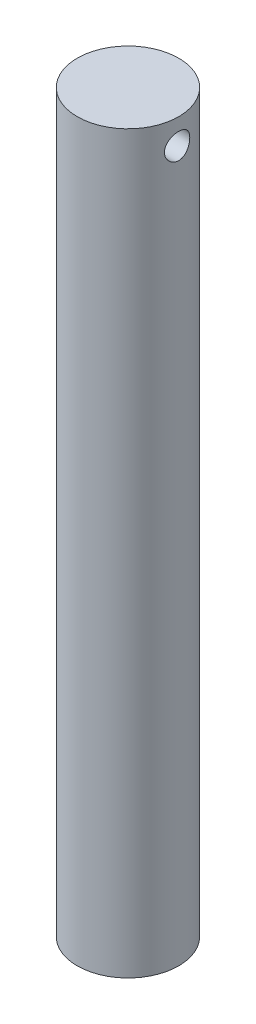
ISO-10303-21;
HEADER;
FILE_DESCRIPTION(('STEP AP214'),'2;1');
FILE_NAME('part.step','',(''),(''),'','','');
FILE_SCHEMA(('AUTOMOTIVE_DESIGN { 1 0 10303 214 1 1 1 1 }'));
ENDSEC;
DATA;
#1=APPLICATION_CONTEXT('core data for automotive mechanical design processes');
#2=APPLICATION_PROTOCOL_DEFINITION('international standard','automotive_design',2000,#1);
#3=PRODUCT_CONTEXT('',#1,'mechanical');
#4=PRODUCT('Part','Part','',(#3));
#5=PRODUCT_RELATED_PRODUCT_CATEGORY('part','',(#4));
#6=PRODUCT_DEFINITION_FORMATION('','',#4);
#7=PRODUCT_DEFINITION_CONTEXT('part definition',#1,'design');
#8=PRODUCT_DEFINITION('design','',#6,#7);
#9=PRODUCT_DEFINITION_SHAPE('','',#8);
#10=(LENGTH_UNIT() NAMED_UNIT(*) SI_UNIT(.MILLI.,.METRE.));
#11=(NAMED_UNIT(*) PLANE_ANGLE_UNIT() SI_UNIT($,.RADIAN.));
#12=(NAMED_UNIT(*) SI_UNIT($,.STERADIAN.) SOLID_ANGLE_UNIT());
#13=UNCERTAINTY_MEASURE_WITH_UNIT(LENGTH_MEASURE(1.E-05),#10,'distance_accuracy_value','');
#14=(GEOMETRIC_REPRESENTATION_CONTEXT(3) GLOBAL_UNCERTAINTY_ASSIGNED_CONTEXT((#13)) GLOBAL_UNIT_ASSIGNED_CONTEXT((#10,
#11,#12)) REPRESENTATION_CONTEXT('',''));
#15=CARTESIAN_POINT('',(0.,0.,0.));
#16=DIRECTION('',(0.,0.,1.));
#17=DIRECTION('',(1.,0.,0.));
#18=AXIS2_PLACEMENT_3D('',#15,#16,#17);
#19=CARTESIAN_POINT('',(0.,184.15,0.));
#20=DIRECTION('',(0.,-1.,0.));
#21=DIRECTION('',(0.,0.,-1.));
#22=AXIS2_PLACEMENT_3D('',#19,#20,#21);
#23=CYLINDRICAL_SURFACE('',#22,12.7);
#24=CARTESIAN_POINT('',(-12.2967221242086,177.8,-3.175));
#25=CARTESIAN_POINT('',(-12.2967254711158,177.975324453677,-3.1749950198132));
#26=CARTESIAN_POINT('',(-12.3005126863854,178.150704021322,-3.16042833178202));
#27=CARTESIAN_POINT('',(-12.3152136473056,178.49642682428,-3.10263936933901));
#28=CARTESIAN_POINT('',(-12.3261315404947,178.666767068175,-3.05940041756247));
#29=CARTESIAN_POINT('',(-12.3537818023711,178.997360493498,-2.94575382353269));
#30=CARTESIAN_POINT('',(-12.3705066621688,179.15762638734,-2.8753812543752));
#31=CARTESIAN_POINT('',(-12.4078770387652,179.464094782726,-2.70957184940195));
#32=CARTESIAN_POINT('',(-12.4285227220068,179.610296686842,-2.61413394947206));
#33=CARTESIAN_POINT('',(-12.4719170977164,179.887704289483,-2.39865970268608));
#34=CARTESIAN_POINT('',(-12.4946993898125,180.018554872445,-2.27817284738413));
#35=CARTESIAN_POINT('',(-12.5395085190442,180.258416970838,-2.01699122140784));
#36=CARTESIAN_POINT('',(-12.5615352853931,180.36742644454,-1.876294563609));
#37=CARTESIAN_POINT('',(-12.6027232771114,180.561964843892,-1.57625440537028));
#38=CARTESIAN_POINT('',(-12.6218402299875,180.647144912965,-1.41667811176781));
#39=CARTESIAN_POINT('',(-12.65467131146,180.789338248074,-1.0849142440518));
#40=CARTESIAN_POINT('',(-12.6683862371462,180.846355669933,-0.912728534955752));
#41=CARTESIAN_POINT('',(-12.6886304373719,180.929467749915,-0.564335623617769));
#42=CARTESIAN_POINT('',(-12.6952996518228,180.956165448295,-0.388280553827185));
#43=CARTESIAN_POINT('',(-12.7011886451627,180.97977314168,-0.0340726004637066));
#44=CARTESIAN_POINT('',(-12.7004095254282,180.976687540706,0.144079969063357));
#45=CARTESIAN_POINT('',(-12.6915938059099,180.941249940182,0.493243384772339));
#46=CARTESIAN_POINT('',(-12.6837186297291,180.909548867182,0.664324984533398));
#47=CARTESIAN_POINT('',(-12.6617836238657,180.818826487038,0.998658935538463));
#48=CARTESIAN_POINT('',(-12.6477234649603,180.759803725571,1.16191086950115));
#49=CARTESIAN_POINT('',(-12.6147513732012,180.615586735227,1.47766628361824));
#50=CARTESIAN_POINT('',(-12.5957967501266,180.53016085328,1.63005931850866));
#51=CARTESIAN_POINT('',(-12.5550917783831,180.335738287522,1.91857510093106));
#52=CARTESIAN_POINT('',(-12.5333409435887,180.226737502928,2.05469501139649));
#53=CARTESIAN_POINT('',(-12.4887191648708,179.984769897682,2.31068256139474));
#54=CARTESIAN_POINT('',(-12.4658338379713,179.851234286718,2.43001063106376));
#55=CARTESIAN_POINT('',(-12.4220610526701,179.565808033604,2.6446999936826));
#56=CARTESIAN_POINT('',(-12.4011736876753,179.413916534046,2.74006016644615));
#57=CARTESIAN_POINT('',(-12.3637103097324,179.095031656631,2.90445230964672));
#58=CARTESIAN_POINT('',(-12.347155693206,178.927968622503,2.97335437513119));
#59=CARTESIAN_POINT('',(-12.3205067298881,178.584116455542,3.08192684552052));
#60=CARTESIAN_POINT('',(-12.3104110007027,178.40732941274,3.12160350580598));
#61=CARTESIAN_POINT('',(-12.2981130212947,178.054051433057,3.16970364110572));
#62=CARTESIAN_POINT('',(-12.2957093300071,177.877676002457,3.17892490187728));
#63=CARTESIAN_POINT('',(-12.2985192607316,177.525906140537,3.16803657795425));
#64=CARTESIAN_POINT('',(-12.3037321815428,177.350511620404,3.14792969326925));
#65=CARTESIAN_POINT('',(-12.3209949412092,177.008644883515,3.07965533920158));
#66=CARTESIAN_POINT('',(-12.3329315220802,176.842073637257,3.03195236671801));
#67=CARTESIAN_POINT('',(-12.3621891219376,176.519292048526,2.91035496372148));
#68=CARTESIAN_POINT('',(-12.3795107787294,176.363082935999,2.83645743059487));
#69=CARTESIAN_POINT('',(-12.418010941113,176.062079577109,2.66289874827948));
#70=CARTESIAN_POINT('',(-12.439258441312,175.917569373145,2.56276062737126));
#71=CARTESIAN_POINT('',(-12.4830469550031,175.647110779242,2.34016643006687));
#72=CARTESIAN_POINT('',(-12.5055881806495,175.521165445854,2.21770668600725));
#73=CARTESIAN_POINT('',(-12.5501070185035,175.288179975935,1.95028413912649));
#74=CARTESIAN_POINT('',(-12.5720564161859,175.181691720563,1.80483494928779));
#75=CARTESIAN_POINT('',(-12.6123346509939,174.994651448972,1.49765601755558));
#76=CARTESIAN_POINT('',(-12.6306636769502,174.914098079908,1.33592712544034));
#77=CARTESIAN_POINT('',(-12.6615204698767,174.78191353615,1.00189729049621));
#78=CARTESIAN_POINT('',(-12.6740898412846,174.730074358839,0.829682684763523));
#79=CARTESIAN_POINT('',(-12.6921932261265,174.656165375047,0.478630489012209));
#80=CARTESIAN_POINT('',(-12.6977285972965,174.634089823401,0.299794184005931));
#81=CARTESIAN_POINT('',(-12.7010848787296,174.620657903098,-0.054240196457561));
#82=CARTESIAN_POINT('',(-12.6991103294396,174.628487073622,-0.229405900617127));
#83=CARTESIAN_POINT('',(-12.6881222125238,174.67277685166,-0.575841801116841));
#84=CARTESIAN_POINT('',(-12.6791088542401,174.709236607667,-0.747112113154456));
#85=CARTESIAN_POINT('',(-12.655087493111,174.809315797773,-1.08004303817217));
#86=CARTESIAN_POINT('',(-12.640112022951,174.872787964273,-1.24175042029425));
#87=CARTESIAN_POINT('',(-12.6057434230086,175.024956588387,-1.55231164340716));
#88=CARTESIAN_POINT('',(-12.5863497364056,175.113656225729,-1.70116386101839));
#89=CARTESIAN_POINT('',(-12.5446551773491,175.316245867938,-1.985651122744));
#90=CARTESIAN_POINT('',(-12.5222957878979,175.43068845372,-2.12088408784723));
#91=CARTESIAN_POINT('',(-12.4774531075658,175.680442555028,-2.37050268936839));
#92=CARTESIAN_POINT('',(-12.4549697867118,175.815759353653,-2.48488303211818));
#93=CARTESIAN_POINT('',(-12.4119473580947,176.106459490052,-2.69164443404807));
#94=CARTESIAN_POINT('',(-12.3914523466269,176.262170091685,-2.78357526664701));
#95=CARTESIAN_POINT('',(-12.3553205869608,176.587326180353,-2.93981789665887));
#96=CARTESIAN_POINT('',(-12.3396803064045,176.756761567348,-3.00414978846308));
#97=CARTESIAN_POINT('',(-12.3174731028359,177.071582012577,-3.09379152821293));
#98=CARTESIAN_POINT('',(-12.3097500503611,177.215460796926,-3.12417831664509));
#99=CARTESIAN_POINT('',(-12.2993733749982,177.506213659068,-3.16478377891537));
#100=CARTESIAN_POINT('',(-12.2967193196792,177.653087480276,-3.17500417313031));
#101=CARTESIAN_POINT('',(-12.2967221242086,177.8,-3.175));
#102=B_SPLINE_CURVE_WITH_KNOTS('',3,(#24,#25,#26,#27,#28,#29,#30,#31,#32,#33,#34,#35,#36,#37,
#38,#39,#40,#41,#42,#43,#44,#45,#46,#47,#48,#49,#50,#51,#52,#53,#54,#55,#56,#57,#58,#59,#60,#61,
#62,#63,#64,#65,#66,#67,#68,#69,#70,#71,#72,#73,#74,#75,#76,#77,#78,#79,#80,#81,#82,#83,#84,#85,
#86,#87,#88,#89,#90,#91,#92,#93,#94,#95,#96,#97,#98,#99,#100,#101),.UNSPECIFIED.,.T.,.F.,(4,2,2,
2,2,2,2,2,2,2,2,2,2,2,2,2,2,2,2,2,2,2,2,2,2,2,2,2,2,2,2,2,2,2,2,2,2,2,4),(0.,0.525433851004907,
1.05117359161441,1.57623602350087,2.10132074979461,2.63682421825079,3.17237772279429,
3.71540400425358,4.25835013005808,4.79029713764091,5.32216548805847,5.84223193614963,
6.36232607040479,6.88711950303145,7.41200429545521,7.9510949254633,8.49021074623751,
9.03194068650673,9.57355464164526,10.1008633995054,10.6281236152971,11.1467570436797,
11.6654519221148,12.1943221424741,12.7232793399029,13.2654717033224,13.8076357797011,
14.3458193247108,14.8838989712076,15.4074297658815,15.9309449907505,16.4516419323711,
16.9724045329363,17.5056431266551,18.0390169009448,18.5823412615974,19.1252693614627,
19.5655924052587,20.0058778838705),.UNSPECIFIED.);
#103=CARTESIAN_POINT('',(-12.2967221242086,177.8,-3.175));
#104=VERTEX_POINT('',#103);
#105=EDGE_CURVE('E10',#104,#104,#102,.T.);
#106=ORIENTED_EDGE('',*,*,#105,.T.);
#107=EDGE_LOOP('',(#106));
#108=FACE_BOUND('',#107,.T.);
#109=CARTESIAN_POINT('',(12.2967221242086,177.8,-3.175));
#110=CARTESIAN_POINT('',(12.2967254711158,177.624675546323,-3.1749950198132));
#111=CARTESIAN_POINT('',(12.3005126863854,177.449295978678,-3.16042833178202));
#112=CARTESIAN_POINT('',(12.3152136473056,177.10357317572,-3.10263936933902));
#113=CARTESIAN_POINT('',(12.3261315404947,176.933232931825,-3.05940041756247));
#114=CARTESIAN_POINT('',(12.3537818023711,176.602639506502,-2.94575382353269));
#115=CARTESIAN_POINT('',(12.3705066621688,176.44237361266,-2.8753812543752));
#116=CARTESIAN_POINT('',(12.4078770387652,176.135905217274,-2.70957184940195));
#117=CARTESIAN_POINT('',(12.4285227220068,175.989703313158,-2.61413394947206));
#118=CARTESIAN_POINT('',(12.4719170977164,175.712295710517,-2.39865970268608));
#119=CARTESIAN_POINT('',(12.4946993898125,175.581445127555,-2.27817284738413));
#120=CARTESIAN_POINT('',(12.5395085190442,175.341583029162,-2.01699122140784));
#121=CARTESIAN_POINT('',(12.5615352853931,175.23257355546,-1.876294563609));
#122=CARTESIAN_POINT('',(12.6027232771114,175.038035156108,-1.57625440537028));
#123=CARTESIAN_POINT('',(12.6218402299875,174.952855087035,-1.41667811176781));
#124=CARTESIAN_POINT('',(12.65467131146,174.810661751926,-1.0849142440518));
#125=CARTESIAN_POINT('',(12.6683862371462,174.753644330067,-0.912728534955752));
#126=CARTESIAN_POINT('',(12.6886304373719,174.670532250085,-0.564335623617769));
#127=CARTESIAN_POINT('',(12.6952996518228,174.643834551705,-0.388280553827185));
#128=CARTESIAN_POINT('',(12.7011886451627,174.62022685832,-0.0340726004637066));
#129=CARTESIAN_POINT('',(12.7004095254282,174.623312459294,0.144079969063357));
#130=CARTESIAN_POINT('',(12.6915938059099,174.658750059818,0.493243384772339));
#131=CARTESIAN_POINT('',(12.6837186297291,174.690451132818,0.664324984533398));
#132=CARTESIAN_POINT('',(12.6617836238657,174.781173512962,0.998658935538463));
#133=CARTESIAN_POINT('',(12.6477234649603,174.840196274429,1.16191086950115));
#134=CARTESIAN_POINT('',(12.6147513732012,174.984413264773,1.47766628361824));
#135=CARTESIAN_POINT('',(12.5957967501266,175.06983914672,1.63005931850866));
#136=CARTESIAN_POINT('',(12.5550917783831,175.264261712478,1.91857510093106));
#137=CARTESIAN_POINT('',(12.5333409435887,175.373262497072,2.05469501139649));
#138=CARTESIAN_POINT('',(12.4887191648708,175.615230102318,2.31068256139474));
#139=CARTESIAN_POINT('',(12.4658338379713,175.748765713282,2.43001063106376));
#140=CARTESIAN_POINT('',(12.4220610526701,176.034191966396,2.6446999936826));
#141=CARTESIAN_POINT('',(12.4011736876753,176.186083465954,2.74006016644615));
#142=CARTESIAN_POINT('',(12.3637103097324,176.504968343369,2.90445230964672));
#143=CARTESIAN_POINT('',(12.347155693206,176.672031377497,2.97335437513119));
#144=CARTESIAN_POINT('',(12.3205067298881,177.015883544458,3.08192684552052));
#145=CARTESIAN_POINT('',(12.3104110007027,177.19267058726,3.12160350580598));
#146=CARTESIAN_POINT('',(12.2981130212947,177.545948566943,3.16970364110572));
#147=CARTESIAN_POINT('',(12.2957093300071,177.722323997543,3.17892490187728));
#148=CARTESIAN_POINT('',(12.2985192607316,178.074093859463,3.16803657795425));
#149=CARTESIAN_POINT('',(12.3037321815428,178.249488379596,3.14792969326925));
#150=CARTESIAN_POINT('',(12.3209949412092,178.591355116485,3.07965533920158));
#151=CARTESIAN_POINT('',(12.3329315220802,178.757926362743,3.03195236671802));
#152=CARTESIAN_POINT('',(12.3621891219376,179.080707951474,2.91035496372149));
#153=CARTESIAN_POINT('',(12.3795107787294,179.236917064001,2.83645743059487));
#154=CARTESIAN_POINT('',(12.418010941113,179.537920422891,2.66289874827948));
#155=CARTESIAN_POINT('',(12.439258441312,179.682430626855,2.56276062737126));
#156=CARTESIAN_POINT('',(12.4830469550031,179.952889220758,2.34016643006687));
#157=CARTESIAN_POINT('',(12.5055881806495,180.078834554146,2.21770668600725));
#158=CARTESIAN_POINT('',(12.5501070185035,180.311820024065,1.95028413912649));
#159=CARTESIAN_POINT('',(12.5720564161859,180.418308279437,1.80483494928779));
#160=CARTESIAN_POINT('',(12.6123346509939,180.605348551028,1.49765601755558));
#161=CARTESIAN_POINT('',(12.6306636769502,180.685901920092,1.33592712544034));
#162=CARTESIAN_POINT('',(12.6615204698767,180.81808646385,1.0018972904962));
#163=CARTESIAN_POINT('',(12.6740898412846,180.869925641161,0.829682684763519));
#164=CARTESIAN_POINT('',(12.6921932261265,180.943834624953,0.478630489012205));
#165=CARTESIAN_POINT('',(12.6977285972965,180.965910176599,0.299794184005929));
#166=CARTESIAN_POINT('',(12.7010848787296,180.979342096902,-0.0542401964575609));
#167=CARTESIAN_POINT('',(12.6991103294396,180.971512926378,-0.229405900617127));
#168=CARTESIAN_POINT('',(12.6881222125238,180.92722314834,-0.575841801116841));
#169=CARTESIAN_POINT('',(12.6791088542401,180.890763392333,-0.747112113154456));
#170=CARTESIAN_POINT('',(12.655087493111,180.790684202228,-1.08004303817217));
#171=CARTESIAN_POINT('',(12.640112022951,180.727212035727,-1.24175042029425));
#172=CARTESIAN_POINT('',(12.6057434230086,180.575043411613,-1.55231164340716));
#173=CARTESIAN_POINT('',(12.5863497364056,180.486343774271,-1.70116386101839));
#174=CARTESIAN_POINT('',(12.5446551773491,180.283754132062,-1.985651122744));
#175=CARTESIAN_POINT('',(12.5222957878979,180.16931154628,-2.12088408784723));
#176=CARTESIAN_POINT('',(12.4774531075658,179.919557444972,-2.37050268936839));
#177=CARTESIAN_POINT('',(12.4549697867118,179.784240646347,-2.48488303211818));
#178=CARTESIAN_POINT('',(12.4119473580947,179.493540509948,-2.69164443404807));
#179=CARTESIAN_POINT('',(12.3914523466269,179.337829908315,-2.783575266647));
#180=CARTESIAN_POINT('',(12.3553205869608,179.012673819647,-2.93981789665886));
#181=CARTESIAN_POINT('',(12.3396803064045,178.843238432652,-3.00414978846308));
#182=CARTESIAN_POINT('',(12.3174731028359,178.528417987423,-3.09379152821293));
#183=CARTESIAN_POINT('',(12.3097500503611,178.384539203074,-3.12417831664509));
#184=CARTESIAN_POINT('',(12.2993733749982,178.093786340932,-3.16478377891537));
#185=CARTESIAN_POINT('',(12.2967193196792,177.946912519724,-3.17500417313031));
#186=CARTESIAN_POINT('',(12.2967221242086,177.8,-3.175));
#187=B_SPLINE_CURVE_WITH_KNOTS('',3,(#109,#110,#111,#112,#113,#114,#115,#116,#117,#118,#119,
#120,#121,#122,#123,#124,#125,#126,#127,#128,#129,#130,#131,#132,#133,#134,#135,#136,#137,#138,
#139,#140,#141,#142,#143,#144,#145,#146,#147,#148,#149,#150,#151,#152,#153,#154,#155,#156,#157,
#158,#159,#160,#161,#162,#163,#164,#165,#166,#167,#168,#169,#170,#171,#172,#173,#174,#175,#176,
#177,#178,#179,#180,#181,#182,#183,#184,#185,#186),.UNSPECIFIED.,.T.,.F.,(4,2,2,2,2,2,2,2,2,2,2,
2,2,2,2,2,2,2,2,2,2,2,2,2,2,2,2,2,2,2,2,2,2,2,2,2,2,2,4),(0.,0.525433851004907,1.05117359161441,
1.57623602350084,2.10132074979461,2.63682421825079,3.17237772279429,3.71540400425358,
4.25835013005808,4.79029713764091,5.32216548805847,5.84223193614963,6.36232607040479,
6.88711950303145,7.41200429545521,7.9510949254633,8.49021074623751,9.03194068650673,
9.57355464164526,10.1008633995054,10.6281236152971,11.1467570436797,11.6654519221148,
12.1943221424741,12.7232793399029,13.2654717033224,13.8076357797011,14.3458193247108,
14.8838989712076,15.4074297658815,15.9309449907505,16.4516419323711,16.9724045329363,
17.5056431266551,18.0390169009448,18.5823412615974,19.1252693614627,19.5655924052587,
20.0058778838705),.UNSPECIFIED.);
#188=CARTESIAN_POINT('',(12.2967221242086,177.8,-3.175));
#189=VERTEX_POINT('',#188);
#190=EDGE_CURVE('E42',#189,#189,#187,.T.);
#191=ORIENTED_EDGE('',*,*,#190,.T.);
#192=EDGE_LOOP('',(#191));
#193=FACE_BOUND('',#192,.T.);
#194=CARTESIAN_POINT('',(0.,184.15,0.));
#195=DIRECTION('',(0.,1.,0.));
#196=DIRECTION('',(0.,0.,1.));
#197=AXIS2_PLACEMENT_3D('',#194,#195,#196);
#198=CIRCLE('',#197,12.7);
#199=CARTESIAN_POINT('',(0.,184.15,12.7));
#200=VERTEX_POINT('',#199);
#201=EDGE_CURVE('E46',#200,#200,#198,.T.);
#202=ORIENTED_EDGE('',*,*,#201,.F.);
#203=EDGE_LOOP('',(#202));
#204=FACE_BOUND('',#203,.T.);
#205=CARTESIAN_POINT('',(0.,0.,0.));
#206=DIRECTION('',(0.,1.,0.));
#207=DIRECTION('',(0.,0.,1.));
#208=AXIS2_PLACEMENT_3D('',#205,#206,#207);
#209=CIRCLE('',#208,12.7);
#210=CARTESIAN_POINT('',(0.,0.,12.7));
#211=VERTEX_POINT('',#210);
#212=EDGE_CURVE('E50',#211,#211,#209,.T.);
#213=ORIENTED_EDGE('',*,*,#212,.T.);
#214=EDGE_LOOP('',(#213));
#215=FACE_BOUND('',#214,.T.);
#216=ADVANCED_FACE('F32',(#108,#193,#204,#215),#23,.T.);
#217=CARTESIAN_POINT('',(0.,184.15,0.));
#218=DIRECTION('',(0.,1.,0.));
#219=DIRECTION('',(0.,0.,1.));
#220=AXIS2_PLACEMENT_3D('',#217,#218,#219);
#221=PLANE('',#220);
#222=ORIENTED_EDGE('',*,*,#201,.T.);
#223=EDGE_LOOP('',(#222));
#224=FACE_BOUND('',#223,.T.);
#225=ADVANCED_FACE('F61',(#224),#221,.T.);
#226=CARTESIAN_POINT('',(0.,0.,0.));
#227=DIRECTION('',(0.,1.,0.));
#228=DIRECTION('',(0.,0.,1.));
#229=AXIS2_PLACEMENT_3D('',#226,#227,#228);
#230=PLANE('',#229);
#231=ORIENTED_EDGE('',*,*,#212,.F.);
#232=EDGE_LOOP('',(#231));
#233=FACE_BOUND('',#232,.T.);
#234=ADVANCED_FACE('F59',(#233),#230,.F.);
#235=CARTESIAN_POINT('',(-12.7,177.8,0.));
#236=DIRECTION('',(1.,0.,0.));
#237=DIRECTION('',(0.,0.,-1.));
#238=AXIS2_PLACEMENT_3D('',#235,#236,#237);
#239=CYLINDRICAL_SURFACE('',#238,3.175);
#240=ORIENTED_EDGE('',*,*,#190,.F.);
#241=EDGE_LOOP('',(#240));
#242=FACE_BOUND('',#241,.T.);
#243=ORIENTED_EDGE('',*,*,#105,.F.);
#244=EDGE_LOOP('',(#243));
#245=FACE_BOUND('',#244,.T.);
#246=ADVANCED_FACE('F55',(#242,#245),#239,.F.);
#247=CLOSED_SHELL('',(#216,#225,#234,#246));
#248=MANIFOLD_SOLID_BREP('B2',#247);
#249=ADVANCED_BREP_SHAPE_REPRESENTATION('',(#18,#248),#14);
#250=SHAPE_DEFINITION_REPRESENTATION(#9,#249);
ENDSEC;
END-ISO-10303-21;
